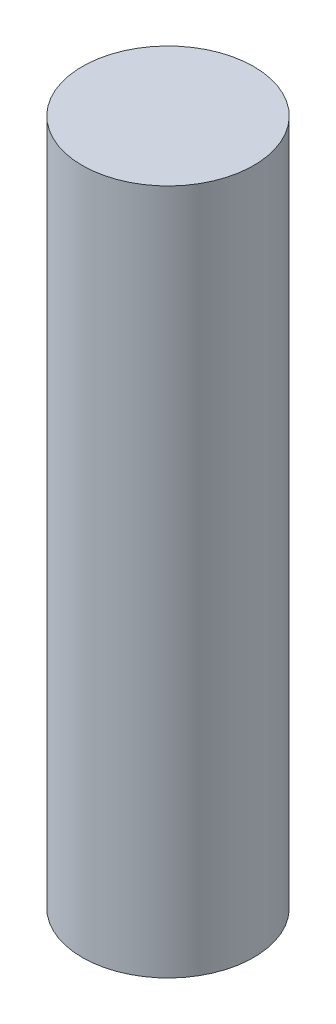
ISO-10303-21;
HEADER;
FILE_DESCRIPTION(('STEP AP214'),'2;1');
FILE_NAME('part.step','',(''),(''),'','','');
FILE_SCHEMA(('AUTOMOTIVE_DESIGN { 1 0 10303 214 1 1 1 1 }'));
ENDSEC;
DATA;
#1=APPLICATION_CONTEXT('core data for automotive mechanical design processes');
#2=APPLICATION_PROTOCOL_DEFINITION('international standard','automotive_design',2000,#1);
#3=PRODUCT_CONTEXT('',#1,'mechanical');
#4=PRODUCT('Part','Part','',(#3));
#5=PRODUCT_RELATED_PRODUCT_CATEGORY('part','',(#4));
#6=PRODUCT_DEFINITION_FORMATION('','',#4);
#7=PRODUCT_DEFINITION_CONTEXT('part definition',#1,'design');
#8=PRODUCT_DEFINITION('design','',#6,#7);
#9=PRODUCT_DEFINITION_SHAPE('','',#8);
#10=(LENGTH_UNIT() NAMED_UNIT(*) SI_UNIT(.MILLI.,.METRE.));
#11=(NAMED_UNIT(*) PLANE_ANGLE_UNIT() SI_UNIT($,.RADIAN.));
#12=(NAMED_UNIT(*) SI_UNIT($,.STERADIAN.) SOLID_ANGLE_UNIT());
#13=UNCERTAINTY_MEASURE_WITH_UNIT(LENGTH_MEASURE(1.E-05),#10,'distance_accuracy_value','');
#14=(GEOMETRIC_REPRESENTATION_CONTEXT(3) GLOBAL_UNCERTAINTY_ASSIGNED_CONTEXT((#13)) GLOBAL_UNIT_ASSIGNED_CONTEXT((#10,
#11,#12)) REPRESENTATION_CONTEXT('',''));
#15=CARTESIAN_POINT('',(0.,0.,0.));
#16=DIRECTION('',(0.,0.,1.));
#17=DIRECTION('',(1.,0.,0.));
#18=AXIS2_PLACEMENT_3D('',#15,#16,#17);
#19=CARTESIAN_POINT('',(0.,25.4,0.));
#20=DIRECTION('',(0.,-1.,0.));
#21=DIRECTION('',(0.,0.,-1.));
#22=AXIS2_PLACEMENT_3D('',#19,#20,#21);
#23=CYLINDRICAL_SURFACE('',#22,3.175);
#24=CARTESIAN_POINT('',(0.,25.4,0.));
#25=DIRECTION('',(0.,1.,0.));
#26=DIRECTION('',(0.,0.,1.));
#27=AXIS2_PLACEMENT_3D('',#24,#25,#26);
#28=CIRCLE('',#27,3.175);
#29=CARTESIAN_POINT('',(0.,25.4,3.175));
#30=VERTEX_POINT('',#29);
#31=EDGE_CURVE('E10',#30,#30,#28,.T.);
#32=ORIENTED_EDGE('',*,*,#31,.F.);
#33=EDGE_LOOP('',(#32));
#34=FACE_BOUND('',#33,.T.);
#35=CARTESIAN_POINT('',(0.,0.,0.));
#36=DIRECTION('',(0.,1.,0.));
#37=DIRECTION('',(0.,0.,1.));
#38=AXIS2_PLACEMENT_3D('',#35,#36,#37);
#39=CIRCLE('',#38,3.175);
#40=CARTESIAN_POINT('',(0.,0.,3.175));
#41=VERTEX_POINT('',#40);
#42=EDGE_CURVE('E36',#41,#41,#39,.T.);
#43=ORIENTED_EDGE('',*,*,#42,.T.);
#44=EDGE_LOOP('',(#43));
#45=FACE_BOUND('',#44,.T.);
#46=ADVANCED_FACE('F33',(#34,#45),#23,.T.);
#47=CARTESIAN_POINT('',(0.,25.4,0.));
#48=DIRECTION('',(0.,1.,0.));
#49=DIRECTION('',(0.,0.,1.));
#50=AXIS2_PLACEMENT_3D('',#47,#48,#49);
#51=PLANE('',#50);
#52=ORIENTED_EDGE('',*,*,#31,.T.);
#53=EDGE_LOOP('',(#52));
#54=FACE_BOUND('',#53,.T.);
#55=ADVANCED_FACE('F48',(#54),#51,.T.);
#56=CARTESIAN_POINT('',(0.,0.,0.));
#57=DIRECTION('',(0.,1.,0.));
#58=DIRECTION('',(0.,0.,1.));
#59=AXIS2_PLACEMENT_3D('',#56,#57,#58);
#60=PLANE('',#59);
#61=ORIENTED_EDGE('',*,*,#42,.F.);
#62=EDGE_LOOP('',(#61));
#63=FACE_BOUND('',#62,.T.);
#64=ADVANCED_FACE('F46',(#63),#60,.F.);
#65=CLOSED_SHELL('',(#46,#55,#64));
#66=MANIFOLD_SOLID_BREP('B2',#65);
#67=ADVANCED_BREP_SHAPE_REPRESENTATION('',(#18,#66),#14);
#68=SHAPE_DEFINITION_REPRESENTATION(#9,#67);
ENDSEC;
END-ISO-10303-21;
